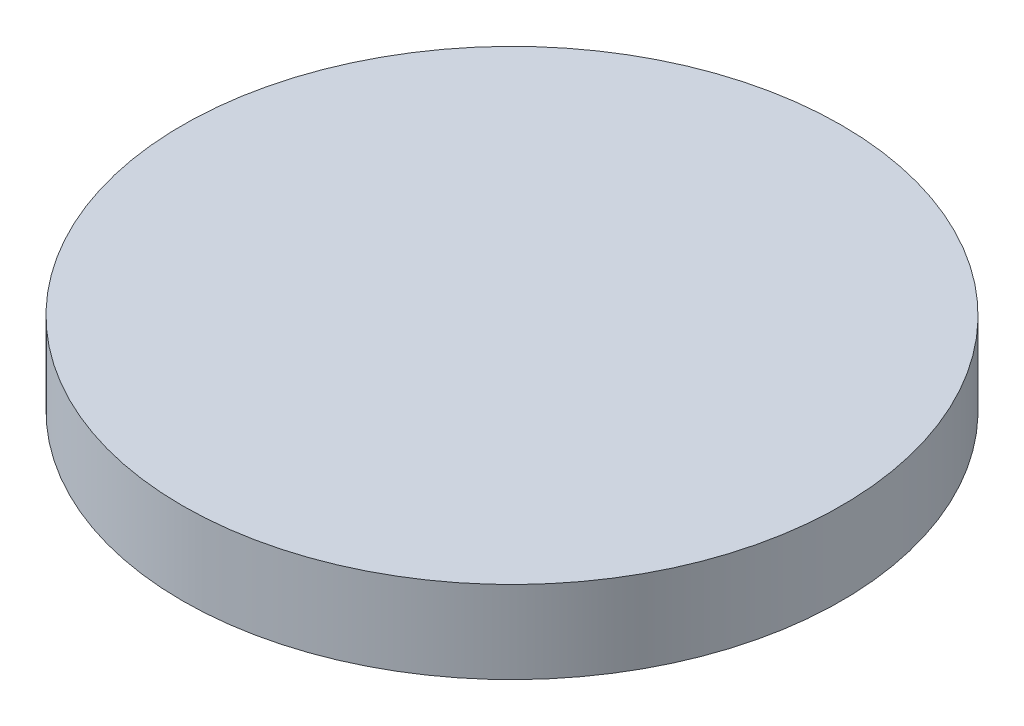
ISO-10303-21;
HEADER;
FILE_DESCRIPTION(('STEP AP214'),'2;1');
FILE_NAME('part.step','',(''),(''),'','','');
FILE_SCHEMA(('AUTOMOTIVE_DESIGN { 1 0 10303 214 1 1 1 1 }'));
ENDSEC;
DATA;
#1=APPLICATION_CONTEXT('core data for automotive mechanical design processes');
#2=APPLICATION_PROTOCOL_DEFINITION('international standard','automotive_design',2000,#1);
#3=PRODUCT_CONTEXT('',#1,'mechanical');
#4=PRODUCT('Part','Part','',(#3));
#5=PRODUCT_RELATED_PRODUCT_CATEGORY('part','',(#4));
#6=PRODUCT_DEFINITION_FORMATION('','',#4);
#7=PRODUCT_DEFINITION_CONTEXT('part definition',#1,'design');
#8=PRODUCT_DEFINITION('design','',#6,#7);
#9=PRODUCT_DEFINITION_SHAPE('','',#8);
#10=(LENGTH_UNIT() NAMED_UNIT(*) SI_UNIT(.MILLI.,.METRE.));
#11=(NAMED_UNIT(*) PLANE_ANGLE_UNIT() SI_UNIT($,.RADIAN.));
#12=(NAMED_UNIT(*) SI_UNIT($,.STERADIAN.) SOLID_ANGLE_UNIT());
#13=UNCERTAINTY_MEASURE_WITH_UNIT(LENGTH_MEASURE(1.E-05),#10,'distance_accuracy_value','');
#14=(GEOMETRIC_REPRESENTATION_CONTEXT(3) GLOBAL_UNCERTAINTY_ASSIGNED_CONTEXT((#13)) GLOBAL_UNIT_ASSIGNED_CONTEXT((#10,
#11,#12)) REPRESENTATION_CONTEXT('',''));
#15=CARTESIAN_POINT('',(0.,0.,0.));
#16=DIRECTION('',(0.,0.,1.));
#17=DIRECTION('',(1.,0.,0.));
#18=AXIS2_PLACEMENT_3D('',#15,#16,#17);
#19=CARTESIAN_POINT('',(0.,3.175,0.));
#20=DIRECTION('',(0.,-1.,0.));
#21=DIRECTION('',(0.,0.,-1.));
#22=AXIS2_PLACEMENT_3D('',#19,#20,#21);
#23=CYLINDRICAL_SURFACE('',#22,12.7);
#24=CARTESIAN_POINT('',(0.,3.175,0.));
#25=DIRECTION('',(0.,1.,0.));
#26=DIRECTION('',(0.,0.,1.));
#27=AXIS2_PLACEMENT_3D('',#24,#25,#26);
#28=CIRCLE('',#27,12.7);
#29=CARTESIAN_POINT('',(0.,3.175,12.7));
#30=VERTEX_POINT('',#29);
#31=EDGE_CURVE('E10',#30,#30,#28,.T.);
#32=ORIENTED_EDGE('',*,*,#31,.F.);
#33=EDGE_LOOP('',(#32));
#34=FACE_BOUND('',#33,.T.);
#35=CARTESIAN_POINT('',(0.,0.,0.));
#36=DIRECTION('',(0.,1.,0.));
#37=DIRECTION('',(0.,0.,1.));
#38=AXIS2_PLACEMENT_3D('',#35,#36,#37);
#39=CIRCLE('',#38,12.7);
#40=CARTESIAN_POINT('',(0.,0.,12.7));
#41=VERTEX_POINT('',#40);
#42=EDGE_CURVE('E34',#41,#41,#39,.T.);
#43=ORIENTED_EDGE('',*,*,#42,.T.);
#44=EDGE_LOOP('',(#43));
#45=FACE_BOUND('',#44,.T.);
#46=ADVANCED_FACE('F31',(#34,#45),#23,.T.);
#47=CARTESIAN_POINT('',(0.,3.175,0.));
#48=DIRECTION('',(0.,1.,0.));
#49=DIRECTION('',(0.,0.,1.));
#50=AXIS2_PLACEMENT_3D('',#47,#48,#49);
#51=PLANE('',#50);
#52=ORIENTED_EDGE('',*,*,#31,.T.);
#53=EDGE_LOOP('',(#52));
#54=FACE_BOUND('',#53,.T.);
#55=ADVANCED_FACE('F46',(#54),#51,.T.);
#56=CARTESIAN_POINT('',(0.,0.,0.));
#57=DIRECTION('',(0.,1.,0.));
#58=DIRECTION('',(0.,0.,1.));
#59=AXIS2_PLACEMENT_3D('',#56,#57,#58);
#60=PLANE('',#59);
#61=ORIENTED_EDGE('',*,*,#42,.F.);
#62=EDGE_LOOP('',(#61));
#63=FACE_BOUND('',#62,.T.);
#64=ADVANCED_FACE('F44',(#63),#60,.F.);
#65=CLOSED_SHELL('',(#46,#55,#64));
#66=MANIFOLD_SOLID_BREP('B2',#65);
#67=ADVANCED_BREP_SHAPE_REPRESENTATION('',(#18,#66),#14);
#68=SHAPE_DEFINITION_REPRESENTATION(#9,#67);
ENDSEC;
END-ISO-10303-21;
